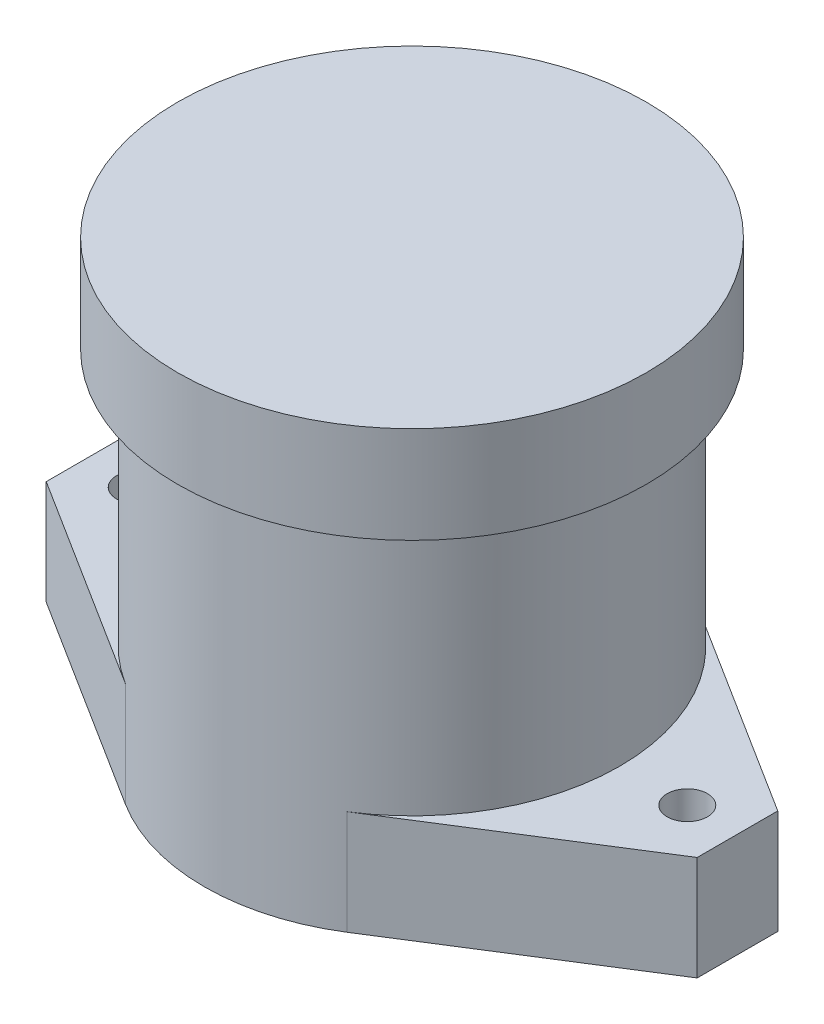
ISO-10303-21;
HEADER;
FILE_DESCRIPTION(('STEP AP214'),'2;1');
FILE_NAME('part.step','',(''),(''),'','','');
FILE_SCHEMA(('AUTOMOTIVE_DESIGN { 1 0 10303 214 1 1 1 1 }'));
ENDSEC;
DATA;
#1=APPLICATION_CONTEXT('core data for automotive mechanical design processes');
#2=APPLICATION_PROTOCOL_DEFINITION('international standard','automotive_design',2000,#1);
#3=PRODUCT_CONTEXT('',#1,'mechanical');
#4=PRODUCT('Part','Part','',(#3));
#5=PRODUCT_RELATED_PRODUCT_CATEGORY('part','',(#4));
#6=PRODUCT_DEFINITION_FORMATION('','',#4);
#7=PRODUCT_DEFINITION_CONTEXT('part definition',#1,'design');
#8=PRODUCT_DEFINITION('design','',#6,#7);
#9=PRODUCT_DEFINITION_SHAPE('','',#8);
#10=(LENGTH_UNIT() NAMED_UNIT(*) SI_UNIT(.MILLI.,.METRE.));
#11=(NAMED_UNIT(*) PLANE_ANGLE_UNIT() SI_UNIT($,.RADIAN.));
#12=(NAMED_UNIT(*) SI_UNIT($,.STERADIAN.) SOLID_ANGLE_UNIT());
#13=UNCERTAINTY_MEASURE_WITH_UNIT(LENGTH_MEASURE(1.E-05),#10,'distance_accuracy_value','');
#14=(GEOMETRIC_REPRESENTATION_CONTEXT(3) GLOBAL_UNCERTAINTY_ASSIGNED_CONTEXT((#13)) GLOBAL_UNIT_ASSIGNED_CONTEXT((#10,
#11,#12)) REPRESENTATION_CONTEXT('',''));
#15=CARTESIAN_POINT('',(0.,0.,0.));
#16=DIRECTION('',(0.,0.,1.));
#17=DIRECTION('',(1.,0.,0.));
#18=AXIS2_PLACEMENT_3D('',#15,#16,#17);
#19=CARTESIAN_POINT('',(0.,12.954,0.));
#20=DIRECTION('',(0.,-1.,0.));
#21=DIRECTION('',(0.,0.,-1.));
#22=AXIS2_PLACEMENT_3D('',#19,#20,#21);
#23=CYLINDRICAL_SURFACE('',#22,25.781);
#24=CARTESIAN_POINT('',(0.,0.,0.));
#25=DIRECTION('',(0.,1.,0.));
#26=DIRECTION('',(0.,0.,-1.));
#27=AXIS2_PLACEMENT_3D('',#24,#25,#26);
#28=CIRCLE('',#27,25.781);
#29=CARTESIAN_POINT('',(13.7583657608226,0.,-21.8029202766837));
#30=VERTEX_POINT('',#29);
#31=CARTESIAN_POINT('',(-13.7583657608226,0.,-21.8029202766837));
#32=VERTEX_POINT('',#31);
#33=EDGE_CURVE('E125',#30,#32,#28,.T.);
#34=ORIENTED_EDGE('',*,*,#33,.T.);
#35=DIRECTION('',(0.,-1.,0.));
#36=VECTOR('',#35,1.);
#37=CARTESIAN_POINT('',(-13.7583657608226,12.954,-21.8029202766837));
#38=LINE('',#37,#36);
#39=CARTESIAN_POINT('',(-13.7583657608226,12.954,-21.8029202766837));
#40=VERTEX_POINT('',#39);
#41=EDGE_CURVE('E121',#40,#32,#38,.T.);
#42=ORIENTED_EDGE('',*,*,#41,.F.);
#43=CARTESIAN_POINT('',(0.,12.954,0.));
#44=DIRECTION('',(0.,1.,0.));
#45=DIRECTION('',(0.,0.,1.));
#46=AXIS2_PLACEMENT_3D('',#43,#44,#45);
#47=CIRCLE('',#46,25.781);
#48=CARTESIAN_POINT('',(-13.7583657608226,12.954,21.8029202766837));
#49=VERTEX_POINT('',#48);
#50=EDGE_CURVE('E50',#40,#49,#47,.T.);
#51=ORIENTED_EDGE('',*,*,#50,.T.);
#52=DIRECTION('',(0.,-1.,0.));
#53=VECTOR('',#52,1.);
#54=CARTESIAN_POINT('',(-13.7583657608226,12.954,21.8029202766837));
#55=LINE('',#54,#53);
#56=CARTESIAN_POINT('',(-13.7583657608226,0.,21.8029202766837));
#57=VERTEX_POINT('',#56);
#58=EDGE_CURVE('E118',#49,#57,#55,.T.);
#59=ORIENTED_EDGE('',*,*,#58,.T.);
#60=CARTESIAN_POINT('',(0.,0.,0.));
#61=DIRECTION('',(0.,1.,0.));
#62=DIRECTION('',(0.,0.,-1.));
#63=AXIS2_PLACEMENT_3D('',#60,#61,#62);
#64=CIRCLE('',#63,25.781);
#65=CARTESIAN_POINT('',(13.7583657608226,0.,21.8029202766837));
#66=VERTEX_POINT('',#65);
#67=EDGE_CURVE('E141',#57,#66,#64,.T.);
#68=ORIENTED_EDGE('',*,*,#67,.T.);
#69=DIRECTION('',(0.,-1.,0.));
#70=VECTOR('',#69,1.);
#71=CARTESIAN_POINT('',(13.7583657608226,12.954,21.8029202766837));
#72=LINE('',#71,#70);
#73=CARTESIAN_POINT('',(13.7583657608226,12.954,21.8029202766837));
#74=VERTEX_POINT('',#73);
#75=EDGE_CURVE('E162',#74,#66,#72,.T.);
#76=ORIENTED_EDGE('',*,*,#75,.F.);
#77=CARTESIAN_POINT('',(13.7583657608226,12.954,-21.8029202766837));
#78=VERTEX_POINT('',#77);
#79=EDGE_CURVE('E120',#74,#78,#47,.T.);
#80=ORIENTED_EDGE('',*,*,#79,.T.);
#81=DIRECTION('',(0.,-1.,0.));
#82=VECTOR('',#81,1.);
#83=CARTESIAN_POINT('',(13.7583657608226,12.954,-21.8029202766837));
#84=LINE('',#83,#82);
#85=EDGE_CURVE('E126',#78,#30,#84,.T.);
#86=ORIENTED_EDGE('',*,*,#85,.T.);
#87=EDGE_LOOP('',(#34,#42,#51,#59,#68,#76,#80,#86));
#88=FACE_BOUND('',#87,.T.);
#89=CARTESIAN_POINT('',(0.,44.896,0.));
#90=DIRECTION('',(0.,1.,0.));
#91=DIRECTION('',(0.,0.,1.));
#92=AXIS2_PLACEMENT_3D('',#89,#90,#91);
#93=CIRCLE('',#92,25.781);
#94=CARTESIAN_POINT('',(0.,44.896,25.781));
#95=VERTEX_POINT('',#94);
#96=EDGE_CURVE('E12',#95,#95,#93,.T.);
#97=ORIENTED_EDGE('',*,*,#96,.F.);
#98=EDGE_LOOP('',(#97));
#99=FACE_BOUND('',#98,.T.);
#100=ADVANCED_FACE('F41',(#88,#99),#23,.T.);
#101=CARTESIAN_POINT('',(0.,12.954,0.));
#102=DIRECTION('',(0.,-1.,0.));
#103=DIRECTION('',(0.,0.,-1.));
#104=AXIS2_PLACEMENT_3D('',#101,#102,#103);
#105=PLANE('',#104);
#106=CARTESIAN_POINT('',(34.163,12.954,0.));
#107=DIRECTION('',(0.,1.,0.));
#108=DIRECTION('',(0.,0.,-1.));
#109=AXIS2_PLACEMENT_3D('',#106,#107,#108);
#110=CIRCLE('',#109,2.5);
#111=CARTESIAN_POINT('',(34.163,12.954,-2.5));
#112=VERTEX_POINT('',#111);
#113=EDGE_CURVE('E190',#112,#112,#110,.T.);
#114=ORIENTED_EDGE('',*,*,#113,.F.);
#115=EDGE_LOOP('',(#114));
#116=FACE_BOUND('',#115,.T.);
#117=ORIENTED_EDGE('',*,*,#79,.F.);
#118=DIRECTION('',(0.8456972296142,0.,-0.533662998364012));
#119=VECTOR('',#118,1.);
#120=CARTESIAN_POINT('',(40.386,12.954,5.));
#121=LINE('',#120,#119);
#122=CARTESIAN_POINT('',(40.386,12.954,5.));
#123=VERTEX_POINT('',#122);
#124=EDGE_CURVE('E183',#74,#123,#121,.T.);
#125=ORIENTED_EDGE('',*,*,#124,.T.);
#126=DIRECTION('',(0.,0.,-1.));
#127=VECTOR('',#126,1.);
#128=CARTESIAN_POINT('',(40.386,12.954,-5.));
#129=LINE('',#128,#127);
#130=CARTESIAN_POINT('',(40.386,12.954,-5.));
#131=VERTEX_POINT('',#130);
#132=EDGE_CURVE('E134',#123,#131,#129,.T.);
#133=ORIENTED_EDGE('',*,*,#132,.T.);
#134=DIRECTION('',(-0.8456972296142,0.,-0.533662998364012));
#135=VECTOR('',#134,1.);
#136=CARTESIAN_POINT('',(13.7583657608226,12.954,-21.8029202766837));
#137=LINE('',#136,#135);
#138=EDGE_CURVE('E130',#131,#78,#137,.T.);
#139=ORIENTED_EDGE('',*,*,#138,.T.);
#140=EDGE_LOOP('',(#117,#125,#133,#139));
#141=FACE_BOUND('',#140,.T.);
#142=ADVANCED_FACE('F223',(#116,#141),#105,.F.);
#143=CARTESIAN_POINT('',(-34.163,12.954,0.));
#144=DIRECTION('',(0.,1.,0.));
#145=DIRECTION('',(0.,0.,1.));
#146=AXIS2_PLACEMENT_3D('',#143,#144,#145);
#147=CIRCLE('',#146,2.5);
#148=CARTESIAN_POINT('',(-34.163,12.954,2.5));
#149=VERTEX_POINT('',#148);
#150=EDGE_CURVE('E142',#149,#149,#147,.T.);
#151=ORIENTED_EDGE('',*,*,#150,.F.);
#152=EDGE_LOOP('',(#151));
#153=FACE_BOUND('',#152,.T.);
#154=ORIENTED_EDGE('',*,*,#50,.F.);
#155=DIRECTION('',(-0.845697229614199,0.,0.533662998364012));
#156=VECTOR('',#155,1.);
#157=CARTESIAN_POINT('',(-40.386,12.954,-5.));
#158=LINE('',#157,#156);
#159=CARTESIAN_POINT('',(-40.386,12.954,-5.));
#160=VERTEX_POINT('',#159);
#161=EDGE_CURVE('E115',#40,#160,#158,.T.);
#162=ORIENTED_EDGE('',*,*,#161,.T.);
#163=DIRECTION('',(0.,0.,1.));
#164=VECTOR('',#163,1.);
#165=CARTESIAN_POINT('',(-40.386,12.954,5.));
#166=LINE('',#165,#164);
#167=CARTESIAN_POINT('',(-40.386,12.954,5.));
#168=VERTEX_POINT('',#167);
#169=EDGE_CURVE('E58',#160,#168,#166,.T.);
#170=ORIENTED_EDGE('',*,*,#169,.T.);
#171=DIRECTION('',(0.845697229614199,0.,0.533662998364012));
#172=VECTOR('',#171,1.);
#173=CARTESIAN_POINT('',(-13.7583657608226,12.954,21.8029202766837));
#174=LINE('',#173,#172);
#175=EDGE_CURVE('E100',#168,#49,#174,.T.);
#176=ORIENTED_EDGE('',*,*,#175,.T.);
#177=EDGE_LOOP('',(#154,#162,#170,#176));
#178=FACE_BOUND('',#177,.T.);
#179=ADVANCED_FACE('F113',(#153,#178),#105,.F.);
#180=CARTESIAN_POINT('',(0.,0.,0.));
#181=DIRECTION('',(0.,-1.,0.));
#182=DIRECTION('',(0.,0.,-1.));
#183=AXIS2_PLACEMENT_3D('',#180,#181,#182);
#184=PLANE('',#183);
#185=CARTESIAN_POINT('',(-34.163,0.,0.));
#186=DIRECTION('',(0.,1.,0.));
#187=DIRECTION('',(0.,0.,1.));
#188=AXIS2_PLACEMENT_3D('',#185,#186,#187);
#189=CIRCLE('',#188,2.5);
#190=CARTESIAN_POINT('',(-34.163,0.,2.5));
#191=VERTEX_POINT('',#190);
#192=EDGE_CURVE('E187',#191,#191,#189,.T.);
#193=ORIENTED_EDGE('',*,*,#192,.T.);
#194=EDGE_LOOP('',(#193));
#195=FACE_BOUND('',#194,.T.);
#196=DIRECTION('',(0.845697229614199,0.,0.533662998364012));
#197=VECTOR('',#196,1.);
#198=CARTESIAN_POINT('',(-13.7583657608226,0.,21.8029202766837));
#199=LINE('',#198,#197);
#200=CARTESIAN_POINT('',(-40.386,0.,5.));
#201=VERTEX_POINT('',#200);
#202=EDGE_CURVE('E138',#201,#57,#199,.T.);
#203=ORIENTED_EDGE('',*,*,#202,.F.);
#204=DIRECTION('',(0.,0.,1.));
#205=VECTOR('',#204,1.);
#206=CARTESIAN_POINT('',(-40.386,0.,5.));
#207=LINE('',#206,#205);
#208=CARTESIAN_POINT('',(-40.386,0.,-5.));
#209=VERTEX_POINT('',#208);
#210=EDGE_CURVE('E94',#209,#201,#207,.T.);
#211=ORIENTED_EDGE('',*,*,#210,.F.);
#212=DIRECTION('',(-0.845697229614199,0.,0.533662998364012));
#213=VECTOR('',#212,1.);
#214=CARTESIAN_POINT('',(-40.386,0.,-5.));
#215=LINE('',#214,#213);
#216=EDGE_CURVE('E88',#32,#209,#215,.T.);
#217=ORIENTED_EDGE('',*,*,#216,.F.);
#218=ORIENTED_EDGE('',*,*,#33,.F.);
#219=DIRECTION('',(-0.8456972296142,0.,-0.533662998364012));
#220=VECTOR('',#219,1.);
#221=CARTESIAN_POINT('',(13.7583657608226,0.,-21.8029202766837));
#222=LINE('',#221,#220);
#223=CARTESIAN_POINT('',(40.386,0.,-5.));
#224=VERTEX_POINT('',#223);
#225=EDGE_CURVE('E148',#224,#30,#222,.T.);
#226=ORIENTED_EDGE('',*,*,#225,.F.);
#227=DIRECTION('',(0.,0.,-1.));
#228=VECTOR('',#227,1.);
#229=CARTESIAN_POINT('',(40.386,0.,-5.));
#230=LINE('',#229,#228);
#231=CARTESIAN_POINT('',(40.386,0.,5.));
#232=VERTEX_POINT('',#231);
#233=EDGE_CURVE('E146',#232,#224,#230,.T.);
#234=ORIENTED_EDGE('',*,*,#233,.F.);
#235=DIRECTION('',(0.8456972296142,0.,-0.533662998364012));
#236=VECTOR('',#235,1.);
#237=CARTESIAN_POINT('',(40.386,0.,5.));
#238=LINE('',#237,#236);
#239=EDGE_CURVE('E144',#66,#232,#238,.T.);
#240=ORIENTED_EDGE('',*,*,#239,.F.);
#241=ORIENTED_EDGE('',*,*,#67,.F.);
#242=EDGE_LOOP('',(#203,#211,#217,#218,#226,#234,#240,#241));
#243=FACE_BOUND('',#242,.T.);
#244=CARTESIAN_POINT('',(34.163,0.,0.));
#245=DIRECTION('',(0.,1.,0.));
#246=DIRECTION('',(0.,0.,-1.));
#247=AXIS2_PLACEMENT_3D('',#244,#245,#246);
#248=CIRCLE('',#247,2.5);
#249=CARTESIAN_POINT('',(34.163,0.,-2.5));
#250=VERTEX_POINT('',#249);
#251=EDGE_CURVE('E193',#250,#250,#248,.T.);
#252=ORIENTED_EDGE('',*,*,#251,.T.);
#253=EDGE_LOOP('',(#252));
#254=FACE_BOUND('',#253,.T.);
#255=ADVANCED_FACE('F168',(#195,#243,#254),#184,.T.);
#256=CARTESIAN_POINT('',(-13.7583657608226,12.954,21.8029202766837));
#257=DIRECTION('',(0.533662998364012,0.,-0.8456972296142));
#258=DIRECTION('',(-0.8456972296142,0.,-0.533662998364012));
#259=AXIS2_PLACEMENT_3D('',#256,#257,#258);
#260=PLANE('',#259);
#261=ORIENTED_EDGE('',*,*,#202,.T.);
#262=ORIENTED_EDGE('',*,*,#58,.F.);
#263=ORIENTED_EDGE('',*,*,#175,.F.);
#264=DIRECTION('',(0.,-1.,0.));
#265=VECTOR('',#264,1.);
#266=CARTESIAN_POINT('',(-40.386,12.954,5.));
#267=LINE('',#266,#265);
#268=EDGE_CURVE('E132',#168,#201,#267,.T.);
#269=ORIENTED_EDGE('',*,*,#268,.T.);
#270=EDGE_LOOP('',(#261,#262,#263,#269));
#271=FACE_BOUND('',#270,.T.);
#272=ADVANCED_FACE('F43',(#271),#260,.F.);
#273=CARTESIAN_POINT('',(40.386,12.954,5.));
#274=DIRECTION('',(-0.533662998364012,0.,-0.8456972296142));
#275=DIRECTION('',(-0.8456972296142,0.,0.533662998364012));
#276=AXIS2_PLACEMENT_3D('',#273,#274,#275);
#277=PLANE('',#276);
#278=ORIENTED_EDGE('',*,*,#239,.T.);
#279=DIRECTION('',(0.,-1.,0.));
#280=VECTOR('',#279,1.);
#281=CARTESIAN_POINT('',(40.386,12.954,5.));
#282=LINE('',#281,#280);
#283=EDGE_CURVE('E159',#123,#232,#282,.T.);
#284=ORIENTED_EDGE('',*,*,#283,.F.);
#285=ORIENTED_EDGE('',*,*,#124,.F.);
#286=ORIENTED_EDGE('',*,*,#75,.T.);
#287=EDGE_LOOP('',(#278,#284,#285,#286));
#288=FACE_BOUND('',#287,.T.);
#289=ADVANCED_FACE('F175',(#288),#277,.F.);
#290=CARTESIAN_POINT('',(40.386,12.954,-5.));
#291=DIRECTION('',(-1.,0.,0.));
#292=DIRECTION('',(0.,0.,1.));
#293=AXIS2_PLACEMENT_3D('',#290,#291,#292);
#294=PLANE('',#293);
#295=ORIENTED_EDGE('',*,*,#233,.T.);
#296=DIRECTION('',(0.,-1.,0.));
#297=VECTOR('',#296,1.);
#298=CARTESIAN_POINT('',(40.386,12.954,-5.));
#299=LINE('',#298,#297);
#300=EDGE_CURVE('E156',#131,#224,#299,.T.);
#301=ORIENTED_EDGE('',*,*,#300,.F.);
#302=ORIENTED_EDGE('',*,*,#132,.F.);
#303=ORIENTED_EDGE('',*,*,#283,.T.);
#304=EDGE_LOOP('',(#295,#301,#302,#303));
#305=FACE_BOUND('',#304,.T.);
#306=ADVANCED_FACE('F179',(#305),#294,.F.);
#307=CARTESIAN_POINT('',(13.7583657608226,12.954,-21.8029202766837));
#308=DIRECTION('',(-0.533662998364012,0.,0.8456972296142));
#309=DIRECTION('',(0.8456972296142,0.,0.533662998364012));
#310=AXIS2_PLACEMENT_3D('',#307,#308,#309);
#311=PLANE('',#310);
#312=ORIENTED_EDGE('',*,*,#225,.T.);
#313=ORIENTED_EDGE('',*,*,#85,.F.);
#314=ORIENTED_EDGE('',*,*,#138,.F.);
#315=ORIENTED_EDGE('',*,*,#300,.T.);
#316=EDGE_LOOP('',(#312,#313,#314,#315));
#317=FACE_BOUND('',#316,.T.);
#318=ADVANCED_FACE('F234',(#317),#311,.F.);
#319=CARTESIAN_POINT('',(-40.386,12.954,-5.));
#320=DIRECTION('',(0.533662998364012,0.,0.8456972296142));
#321=DIRECTION('',(0.8456972296142,0.,-0.533662998364012));
#322=AXIS2_PLACEMENT_3D('',#319,#320,#321);
#323=PLANE('',#322);
#324=ORIENTED_EDGE('',*,*,#216,.T.);
#325=DIRECTION('',(0.,-1.,0.));
#326=VECTOR('',#325,1.);
#327=CARTESIAN_POINT('',(-40.386,12.954,-5.));
#328=LINE('',#327,#326);
#329=EDGE_CURVE('E127',#160,#209,#328,.T.);
#330=ORIENTED_EDGE('',*,*,#329,.F.);
#331=ORIENTED_EDGE('',*,*,#161,.F.);
#332=ORIENTED_EDGE('',*,*,#41,.T.);
#333=EDGE_LOOP('',(#324,#330,#331,#332));
#334=FACE_BOUND('',#333,.T.);
#335=ADVANCED_FACE('F129',(#334),#323,.F.);
#336=CARTESIAN_POINT('',(-40.386,12.954,5.));
#337=DIRECTION('',(1.,0.,0.));
#338=DIRECTION('',(0.,0.,-1.));
#339=AXIS2_PLACEMENT_3D('',#336,#337,#338);
#340=PLANE('',#339);
#341=ORIENTED_EDGE('',*,*,#210,.T.);
#342=ORIENTED_EDGE('',*,*,#268,.F.);
#343=ORIENTED_EDGE('',*,*,#169,.F.);
#344=ORIENTED_EDGE('',*,*,#329,.T.);
#345=EDGE_LOOP('',(#341,#342,#343,#344));
#346=FACE_BOUND('',#345,.T.);
#347=ADVANCED_FACE('F253',(#346),#340,.F.);
#348=CARTESIAN_POINT('',(-34.163,12.954,0.));
#349=DIRECTION('',(0.,-1.,0.));
#350=DIRECTION('',(0.,0.,-1.));
#351=AXIS2_PLACEMENT_3D('',#348,#349,#350);
#352=CYLINDRICAL_SURFACE('',#351,2.5);
#353=ORIENTED_EDGE('',*,*,#150,.T.);
#354=EDGE_LOOP('',(#353));
#355=FACE_BOUND('',#354,.T.);
#356=ORIENTED_EDGE('',*,*,#192,.F.);
#357=EDGE_LOOP('',(#356));
#358=FACE_BOUND('',#357,.T.);
#359=ADVANCED_FACE('F255',(#355,#358),#352,.F.);
#360=CARTESIAN_POINT('',(34.163,12.954,0.));
#361=DIRECTION('',(0.,-1.,0.));
#362=DIRECTION('',(0.,0.,-1.));
#363=AXIS2_PLACEMENT_3D('',#360,#361,#362);
#364=CYLINDRICAL_SURFACE('',#363,2.5);
#365=ORIENTED_EDGE('',*,*,#113,.T.);
#366=EDGE_LOOP('',(#365));
#367=FACE_BOUND('',#366,.T.);
#368=ORIENTED_EDGE('',*,*,#251,.F.);
#369=EDGE_LOOP('',(#368));
#370=FACE_BOUND('',#369,.T.);
#371=ADVANCED_FACE('F220',(#367,#370),#364,.F.);
#372=CARTESIAN_POINT('',(0.,44.896,0.));
#373=DIRECTION('',(0.,1.,0.));
#374=DIRECTION('',(0.,0.,1.));
#375=AXIS2_PLACEMENT_3D('',#372,#373,#374);
#376=CYLINDRICAL_SURFACE('',#375,29.083);
#377=CARTESIAN_POINT('',(0.,44.896,0.));
#378=DIRECTION('',(0.,1.,0.));
#379=DIRECTION('',(0.,0.,1.));
#380=AXIS2_PLACEMENT_3D('',#377,#378,#379);
#381=CIRCLE('',#380,29.083);
#382=CARTESIAN_POINT('',(0.,44.896,29.083));
#383=VERTEX_POINT('',#382);
#384=EDGE_CURVE('E199',#383,#383,#381,.T.);
#385=ORIENTED_EDGE('',*,*,#384,.T.);
#386=EDGE_LOOP('',(#385));
#387=FACE_BOUND('',#386,.T.);
#388=CARTESIAN_POINT('',(0.,56.896,0.));
#389=DIRECTION('',(0.,1.,0.));
#390=DIRECTION('',(0.,0.,1.));
#391=AXIS2_PLACEMENT_3D('',#388,#389,#390);
#392=CIRCLE('',#391,29.083);
#393=CARTESIAN_POINT('',(0.,56.896,29.083));
#394=VERTEX_POINT('',#393);
#395=EDGE_CURVE('E200',#394,#394,#392,.T.);
#396=ORIENTED_EDGE('',*,*,#395,.F.);
#397=EDGE_LOOP('',(#396));
#398=FACE_BOUND('',#397,.T.);
#399=ADVANCED_FACE('F206',(#387,#398),#376,.T.);
#400=CARTESIAN_POINT('',(0.,44.896,0.));
#401=DIRECTION('',(0.,1.,0.));
#402=DIRECTION('',(0.,0.,1.));
#403=AXIS2_PLACEMENT_3D('',#400,#401,#402);
#404=PLANE('',#403);
#405=ORIENTED_EDGE('',*,*,#96,.T.);
#406=EDGE_LOOP('',(#405));
#407=FACE_BOUND('',#406,.T.);
#408=ORIENTED_EDGE('',*,*,#384,.F.);
#409=EDGE_LOOP('',(#408));
#410=FACE_BOUND('',#409,.T.);
#411=ADVANCED_FACE('F209',(#407,#410),#404,.F.);
#412=CARTESIAN_POINT('',(0.,56.896,0.));
#413=DIRECTION('',(0.,-1.,0.));
#414=DIRECTION('',(0.,0.,-1.));
#415=AXIS2_PLACEMENT_3D('',#412,#413,#414);
#416=PLANE('',#415);
#417=ORIENTED_EDGE('',*,*,#395,.T.);
#418=EDGE_LOOP('',(#417));
#419=FACE_BOUND('',#418,.T.);
#420=ADVANCED_FACE('F211',(#419),#416,.F.);
#421=CLOSED_SHELL('',(#100,#142,#179,#255,#272,#289,#306,#318,#335,#347,#359,#371,#399,#411,#420));
#422=MANIFOLD_SOLID_BREP('B2',#421);
#423=ADVANCED_BREP_SHAPE_REPRESENTATION('',(#18,#422),#14);
#424=SHAPE_DEFINITION_REPRESENTATION(#9,#423);
ENDSEC;
END-ISO-10303-21;
